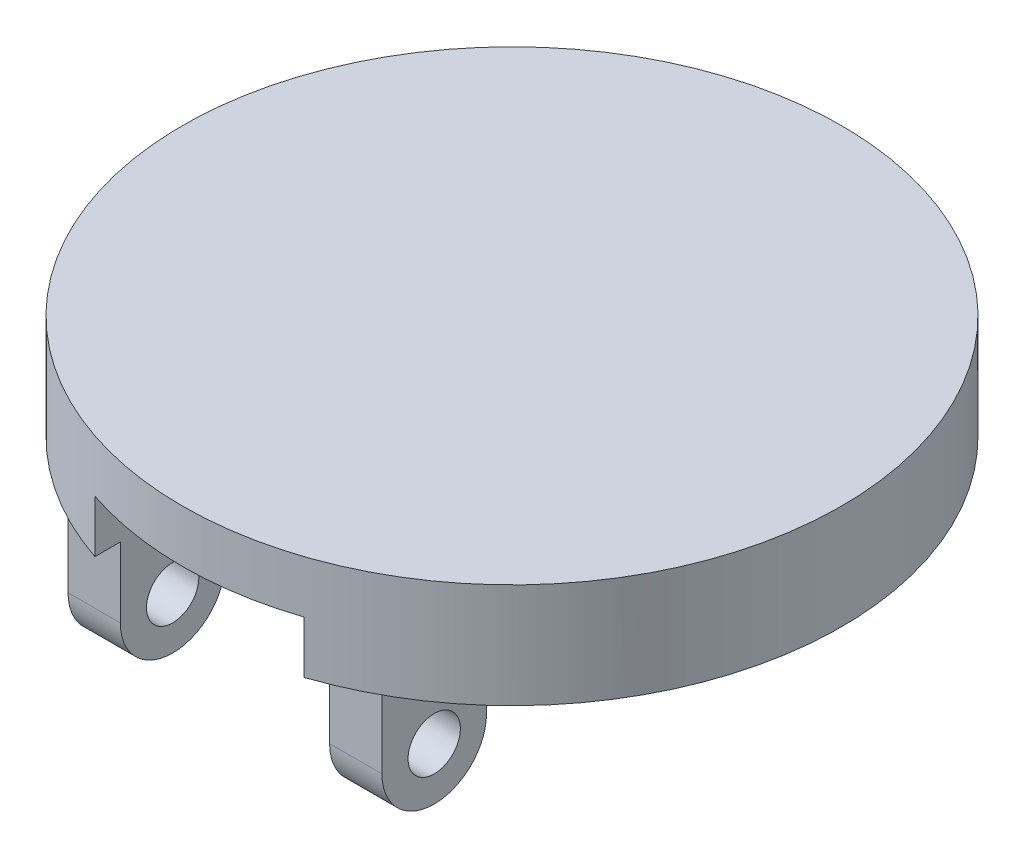
ISO-10303-21;
HEADER;
FILE_DESCRIPTION(('STEP AP214'),'2;1');
FILE_NAME('part.step','',(''),(''),'','','');
FILE_SCHEMA(('AUTOMOTIVE_DESIGN { 1 0 10303 214 1 1 1 1 }'));
ENDSEC;
DATA;
#1=APPLICATION_CONTEXT('core data for automotive mechanical design processes');
#2=APPLICATION_PROTOCOL_DEFINITION('international standard','automotive_design',2000,#1);
#3=PRODUCT_CONTEXT('',#1,'mechanical');
#4=PRODUCT('Part','Part','',(#3));
#5=PRODUCT_RELATED_PRODUCT_CATEGORY('part','',(#4));
#6=PRODUCT_DEFINITION_FORMATION('','',#4);
#7=PRODUCT_DEFINITION_CONTEXT('part definition',#1,'design');
#8=PRODUCT_DEFINITION('design','',#6,#7);
#9=PRODUCT_DEFINITION_SHAPE('','',#8);
#10=(LENGTH_UNIT() NAMED_UNIT(*) SI_UNIT(.MILLI.,.METRE.));
#11=(NAMED_UNIT(*) PLANE_ANGLE_UNIT() SI_UNIT($,.RADIAN.));
#12=(NAMED_UNIT(*) SI_UNIT($,.STERADIAN.) SOLID_ANGLE_UNIT());
#13=UNCERTAINTY_MEASURE_WITH_UNIT(LENGTH_MEASURE(1.E-05),#10,'distance_accuracy_value','');
#14=(GEOMETRIC_REPRESENTATION_CONTEXT(3) GLOBAL_UNCERTAINTY_ASSIGNED_CONTEXT((#13)) GLOBAL_UNIT_ASSIGNED_CONTEXT((#10,
#11,#12)) REPRESENTATION_CONTEXT('',''));
#15=CARTESIAN_POINT('',(0.,0.,0.));
#16=DIRECTION('',(0.,0.,1.));
#17=DIRECTION('',(1.,0.,0.));
#18=AXIS2_PLACEMENT_3D('',#15,#16,#17);
#19=CARTESIAN_POINT('',(0.,6.35,0.));
#20=DIRECTION('',(0.,-1.,0.));
#21=DIRECTION('',(0.,0.,-1.));
#22=AXIS2_PLACEMENT_3D('',#19,#20,#21);
#23=CYLINDRICAL_SURFACE('',#22,20.000000005);
#24=CARTESIAN_POINT('',(0.,6.35,0.));
#25=DIRECTION('',(0.,1.,0.));
#26=DIRECTION('',(0.,0.,1.));
#27=AXIS2_PLACEMENT_3D('',#24,#25,#26);
#28=CIRCLE('',#27,20.000000005);
#29=CARTESIAN_POINT('',(0.,6.35,20.000000005));
#30=VERTEX_POINT('',#29);
#31=EDGE_CURVE('E238',#30,#30,#28,.T.);
#32=ORIENTED_EDGE('',*,*,#31,.F.);
#33=EDGE_LOOP('',(#32));
#34=FACE_BOUND('',#33,.T.);
#35=CARTESIAN_POINT('',(0.,3.175,0.));
#36=DIRECTION('',(0.,-1.,0.));
#37=DIRECTION('',(0.,0.,-1.));
#38=AXIS2_PLACEMENT_3D('',#35,#36,#37);
#39=CIRCLE('',#38,20.000000005);
#40=CARTESIAN_POINT('',(6.35,3.175,18.9651654408813));
#41=VERTEX_POINT('',#40);
#42=CARTESIAN_POINT('',(-6.35,3.175,18.9651654408813));
#43=VERTEX_POINT('',#42);
#44=EDGE_CURVE('E143',#41,#43,#39,.T.);
#45=ORIENTED_EDGE('',*,*,#44,.F.);
#46=DIRECTION('',(0.,-1.,0.));
#47=VECTOR('',#46,1.);
#48=CARTESIAN_POINT('',(6.35,3.175,18.9651654408813));
#49=LINE('',#48,#47);
#50=CARTESIAN_POINT('',(6.35,0.,18.9651654408813));
#51=VERTEX_POINT('',#50);
#52=EDGE_CURVE('E166',#41,#51,#49,.T.);
#53=ORIENTED_EDGE('',*,*,#52,.T.);
#54=CARTESIAN_POINT('',(0.,0.,0.));
#55=DIRECTION('',(0.,1.,0.));
#56=DIRECTION('',(0.,0.,1.));
#57=AXIS2_PLACEMENT_3D('',#54,#55,#56);
#58=CIRCLE('',#57,20.000000005);
#59=CARTESIAN_POINT('',(-6.35,0.,18.9651654408813));
#60=VERTEX_POINT('',#59);
#61=EDGE_CURVE('E156',#51,#60,#58,.T.);
#62=ORIENTED_EDGE('',*,*,#61,.T.);
#63=DIRECTION('',(0.,-1.,0.));
#64=VECTOR('',#63,1.);
#65=CARTESIAN_POINT('',(-6.35,3.175,18.9651654408813));
#66=LINE('',#65,#64);
#67=EDGE_CURVE('E135',#43,#60,#66,.T.);
#68=ORIENTED_EDGE('',*,*,#67,.F.);
#69=EDGE_LOOP('',(#45,#53,#62,#68));
#70=FACE_BOUND('',#69,.T.);
#71=ADVANCED_FACE('F33',(#34,#70),#23,.T.);
#72=CARTESIAN_POINT('',(0.,6.35,0.));
#73=DIRECTION('',(0.,1.,0.));
#74=DIRECTION('',(0.,0.,1.));
#75=AXIS2_PLACEMENT_3D('',#72,#73,#74);
#76=PLANE('',#75);
#77=ORIENTED_EDGE('',*,*,#31,.T.);
#78=EDGE_LOOP('',(#77));
#79=FACE_BOUND('',#78,.T.);
#80=ADVANCED_FACE('F301',(#79),#76,.T.);
#81=CARTESIAN_POINT('',(0.,0.,0.));
#82=DIRECTION('',(0.,1.,0.));
#83=DIRECTION('',(0.,0.,1.));
#84=AXIS2_PLACEMENT_3D('',#81,#82,#83);
#85=PLANE('',#84);
#86=ORIENTED_EDGE('',*,*,#61,.F.);
#87=DIRECTION('',(0.,0.,1.));
#88=VECTOR('',#87,1.);
#89=CARTESIAN_POINT('',(6.35,0.,18.9651654408813));
#90=LINE('',#89,#88);
#91=CARTESIAN_POINT('',(6.35,0.,17.4200827178043));
#92=VERTEX_POINT('',#91);
#93=EDGE_CURVE('E262',#92,#51,#90,.T.);
#94=ORIENTED_EDGE('',*,*,#93,.F.);
#95=DIRECTION('',(-1.,0.,0.));
#96=VECTOR('',#95,1.);
#97=CARTESIAN_POINT('',(9.525,0.,17.4200827178043));
#98=LINE('',#97,#96);
#99=CARTESIAN_POINT('',(9.525,0.,17.4200827178043));
#100=VERTEX_POINT('',#99);
#101=EDGE_CURVE('E235',#100,#92,#98,.T.);
#102=ORIENTED_EDGE('',*,*,#101,.F.);
#103=DIRECTION('',(0.,0.,-1.));
#104=VECTOR('',#103,1.);
#105=CARTESIAN_POINT('',(9.525,0.,0.));
#106=LINE('',#105,#104);
#107=CARTESIAN_POINT('',(9.525,0.,7.89508271780427));
#108=VERTEX_POINT('',#107);
#109=EDGE_CURVE('E41',#100,#108,#106,.T.);
#110=ORIENTED_EDGE('',*,*,#109,.T.);
#111=DIRECTION('',(-1.,0.,0.));
#112=VECTOR('',#111,1.);
#113=CARTESIAN_POINT('',(9.525,0.,7.89508271780427));
#114=LINE('',#113,#112);
#115=CARTESIAN_POINT('',(6.35,0.,7.89508271780427));
#116=VERTEX_POINT('',#115);
#117=EDGE_CURVE('E216',#108,#116,#114,.T.);
#118=ORIENTED_EDGE('',*,*,#117,.T.);
#119=CARTESIAN_POINT('',(6.35,0.,7.6056090725816));
#120=VERTEX_POINT('',#119);
#121=EDGE_CURVE('E152',#120,#116,#90,.T.);
#122=ORIENTED_EDGE('',*,*,#121,.F.);
#123=CARTESIAN_POINT('',(0.,0.,0.));
#124=DIRECTION('',(0.,-1.,0.));
#125=DIRECTION('',(0.,0.,-1.));
#126=AXIS2_PLACEMENT_3D('',#123,#124,#125);
#127=CIRCLE('',#126,9.90796595497459);
#128=CARTESIAN_POINT('',(-6.35,0.,7.6056090725816));
#129=VERTEX_POINT('',#128);
#130=EDGE_CURVE('E264',#129,#120,#127,.T.);
#131=ORIENTED_EDGE('',*,*,#130,.F.);
#132=DIRECTION('',(0.,0.,-1.));
#133=VECTOR('',#132,1.);
#134=CARTESIAN_POINT('',(-6.35,0.,7.6056090725816));
#135=LINE('',#134,#133);
#136=CARTESIAN_POINT('',(-6.35,0.,7.89508271780427));
#137=VERTEX_POINT('',#136);
#138=EDGE_CURVE('E270',#137,#129,#135,.T.);
#139=ORIENTED_EDGE('',*,*,#138,.F.);
#140=DIRECTION('',(1.,0.,0.));
#141=VECTOR('',#140,1.);
#142=CARTESIAN_POINT('',(-9.525,0.,7.89508271780427));
#143=LINE('',#142,#141);
#144=CARTESIAN_POINT('',(-9.525,0.,7.89508271780427));
#145=VERTEX_POINT('',#144);
#146=EDGE_CURVE('E47',#145,#137,#143,.T.);
#147=ORIENTED_EDGE('',*,*,#146,.F.);
#148=DIRECTION('',(0.,0.,1.));
#149=VECTOR('',#148,1.);
#150=CARTESIAN_POINT('',(-9.525,0.,0.));
#151=LINE('',#150,#149);
#152=CARTESIAN_POINT('',(-9.525,0.,17.4200827178043));
#153=VERTEX_POINT('',#152);
#154=EDGE_CURVE('E11',#145,#153,#151,.T.);
#155=ORIENTED_EDGE('',*,*,#154,.T.);
#156=DIRECTION('',(1.,0.,0.));
#157=VECTOR('',#156,1.);
#158=CARTESIAN_POINT('',(-9.525,0.,17.4200827178043));
#159=LINE('',#158,#157);
#160=CARTESIAN_POINT('',(-6.35,0.,17.4200827178043));
#161=VERTEX_POINT('',#160);
#162=EDGE_CURVE('E187',#153,#161,#159,.T.);
#163=ORIENTED_EDGE('',*,*,#162,.T.);
#164=EDGE_CURVE('E268',#60,#161,#135,.T.);
#165=ORIENTED_EDGE('',*,*,#164,.F.);
#166=EDGE_LOOP('',(#86,#94,#102,#110,#118,#122,#131,#139,#147,#155,#163,#165));
#167=FACE_BOUND('',#166,.T.);
#168=ADVANCED_FACE('F243',(#167),#85,.F.);
#169=CARTESIAN_POINT('',(9.525,-3.17499999999998,7.89508271780427));
#170=DIRECTION('',(1.,0.,0.));
#171=DIRECTION('',(0.,0.,-1.));
#172=AXIS2_PLACEMENT_3D('',#169,#170,#171);
#173=PLANE('',#172);
#174=CARTESIAN_POINT('',(9.525,-4.25399999999997,14.2450827178043));
#175=DIRECTION('',(1.,0.,0.));
#176=DIRECTION('',(0.,0.,-1.));
#177=AXIS2_PLACEMENT_3D('',#174,#175,#176);
#178=CIRCLE('',#177,1.5875);
#179=CARTESIAN_POINT('',(9.525,-4.25399999999997,12.6575827178043));
#180=VERTEX_POINT('',#179);
#181=EDGE_CURVE('E163',#180,#180,#178,.T.);
#182=ORIENTED_EDGE('',*,*,#181,.F.);
#183=EDGE_LOOP('',(#182));
#184=FACE_BOUND('',#183,.T.);
#185=ORIENTED_EDGE('',*,*,#109,.F.);
#186=DIRECTION('',(0.,-1.,0.));
#187=VECTOR('',#186,1.);
#188=CARTESIAN_POINT('',(9.525,0.,17.4200827178043));
#189=LINE('',#188,#187);
#190=CARTESIAN_POINT('',(9.525,-4.25399999999997,17.4200827178043));
#191=VERTEX_POINT('',#190);
#192=EDGE_CURVE('E206',#100,#191,#189,.T.);
#193=ORIENTED_EDGE('',*,*,#192,.T.);
#194=CARTESIAN_POINT('',(9.525,-4.25399999999997,14.2450827178043));
#195=DIRECTION('',(1.,0.,0.));
#196=DIRECTION('',(0.,0.,-1.));
#197=AXIS2_PLACEMENT_3D('',#194,#195,#196);
#198=CIRCLE('',#197,3.175);
#199=CARTESIAN_POINT('',(9.525,-4.25399999999997,11.0700827178043));
#200=VERTEX_POINT('',#199);
#201=EDGE_CURVE('E208',#191,#200,#198,.T.);
#202=ORIENTED_EDGE('',*,*,#201,.T.);
#203=DIRECTION('',(0.,1.,0.));
#204=VECTOR('',#203,1.);
#205=CARTESIAN_POINT('',(9.525,-3.17499999999998,11.0700827178043));
#206=LINE('',#205,#204);
#207=CARTESIAN_POINT('',(9.525,-3.17499999999998,11.0700827178043));
#208=VERTEX_POINT('',#207);
#209=EDGE_CURVE('E211',#200,#208,#206,.T.);
#210=ORIENTED_EDGE('',*,*,#209,.T.);
#211=CARTESIAN_POINT('',(9.525,-3.17499999999998,7.89508271780427));
#212=DIRECTION('',(-1.,0.,0.));
#213=DIRECTION('',(0.,0.,-1.));
#214=AXIS2_PLACEMENT_3D('',#211,#212,#213);
#215=CIRCLE('',#214,3.175);
#216=EDGE_CURVE('E213',#208,#108,#215,.T.);
#217=ORIENTED_EDGE('',*,*,#216,.T.);
#218=EDGE_LOOP('',(#185,#193,#202,#210,#217));
#219=FACE_BOUND('',#218,.T.);
#220=ADVANCED_FACE('F249',(#184,#219),#173,.T.);
#221=CARTESIAN_POINT('',(6.35,-3.17499999999998,7.89508271780427));
#222=DIRECTION('',(1.,0.,0.));
#223=DIRECTION('',(0.,0.,-1.));
#224=AXIS2_PLACEMENT_3D('',#221,#222,#223);
#225=PLANE('',#224);
#226=CARTESIAN_POINT('',(6.35,-4.25399999999997,14.2450827178043));
#227=DIRECTION('',(1.,0.,0.));
#228=DIRECTION('',(0.,0.,-1.));
#229=AXIS2_PLACEMENT_3D('',#226,#227,#228);
#230=CIRCLE('',#229,1.5875);
#231=CARTESIAN_POINT('',(6.35,-4.25399999999997,12.6575827178043));
#232=VERTEX_POINT('',#231);
#233=EDGE_CURVE('E170',#232,#232,#230,.T.);
#234=ORIENTED_EDGE('',*,*,#233,.T.);
#235=EDGE_LOOP('',(#234));
#236=FACE_BOUND('',#235,.T.);
#237=DIRECTION('',(0.,-1.,0.));
#238=VECTOR('',#237,1.);
#239=CARTESIAN_POINT('',(6.35,0.,17.4200827178043));
#240=LINE('',#239,#238);
#241=CARTESIAN_POINT('',(6.35,-4.25399999999997,17.4200827178043));
#242=VERTEX_POINT('',#241);
#243=EDGE_CURVE('E205',#92,#242,#240,.T.);
#244=ORIENTED_EDGE('',*,*,#243,.F.);
#245=ORIENTED_EDGE('',*,*,#93,.T.);
#246=ORIENTED_EDGE('',*,*,#52,.F.);
#247=DIRECTION('',(0.,0.,1.));
#248=VECTOR('',#247,1.);
#249=CARTESIAN_POINT('',(6.35,3.175,18.9651654408813));
#250=LINE('',#249,#248);
#251=CARTESIAN_POINT('',(6.35,3.175,7.6056090725816));
#252=VERTEX_POINT('',#251);
#253=EDGE_CURVE('E149',#252,#41,#250,.T.);
#254=ORIENTED_EDGE('',*,*,#253,.F.);
#255=DIRECTION('',(0.,-1.,0.));
#256=VECTOR('',#255,1.);
#257=CARTESIAN_POINT('',(6.35,3.175,7.6056090725816));
#258=LINE('',#257,#256);
#259=EDGE_CURVE('E158',#252,#120,#258,.T.);
#260=ORIENTED_EDGE('',*,*,#259,.T.);
#261=ORIENTED_EDGE('',*,*,#121,.T.);
#262=CARTESIAN_POINT('',(6.35,-3.17499999999998,7.89508271780427));
#263=DIRECTION('',(-1.,0.,0.));
#264=DIRECTION('',(0.,0.,-1.));
#265=AXIS2_PLACEMENT_3D('',#262,#263,#264);
#266=CIRCLE('',#265,3.175);
#267=CARTESIAN_POINT('',(6.35,-3.17499999999998,11.0700827178043));
#268=VERTEX_POINT('',#267);
#269=EDGE_CURVE('E209',#268,#116,#266,.T.);
#270=ORIENTED_EDGE('',*,*,#269,.F.);
#271=DIRECTION('',(0.,1.,0.));
#272=VECTOR('',#271,1.);
#273=CARTESIAN_POINT('',(6.35,-3.17499999999998,11.0700827178043));
#274=LINE('',#273,#272);
#275=CARTESIAN_POINT('',(6.35,-4.25399999999997,11.0700827178043));
#276=VERTEX_POINT('',#275);
#277=EDGE_CURVE('E220',#276,#268,#274,.T.);
#278=ORIENTED_EDGE('',*,*,#277,.F.);
#279=CARTESIAN_POINT('',(6.35,-4.25399999999997,14.2450827178043));
#280=DIRECTION('',(1.,0.,0.));
#281=DIRECTION('',(0.,0.,-1.));
#282=AXIS2_PLACEMENT_3D('',#279,#280,#281);
#283=CIRCLE('',#282,3.175);
#284=EDGE_CURVE('E218',#242,#276,#283,.T.);
#285=ORIENTED_EDGE('',*,*,#284,.F.);
#286=EDGE_LOOP('',(#244,#245,#246,#254,#260,#261,#270,#278,#285));
#287=FACE_BOUND('',#286,.T.);
#288=ADVANCED_FACE('F258',(#236,#287),#225,.F.);
#289=CARTESIAN_POINT('',(9.525,0.,17.4200827178043));
#290=DIRECTION('',(0.,0.,-1.));
#291=DIRECTION('',(0.,1.,0.));
#292=AXIS2_PLACEMENT_3D('',#289,#290,#291);
#293=PLANE('',#292);
#294=ORIENTED_EDGE('',*,*,#243,.T.);
#295=DIRECTION('',(-1.,0.,0.));
#296=VECTOR('',#295,1.);
#297=CARTESIAN_POINT('',(9.525,-4.25399999999997,17.4200827178043));
#298=LINE('',#297,#296);
#299=EDGE_CURVE('E232',#191,#242,#298,.T.);
#300=ORIENTED_EDGE('',*,*,#299,.F.);
#301=ORIENTED_EDGE('',*,*,#192,.F.);
#302=ORIENTED_EDGE('',*,*,#101,.T.);
#303=EDGE_LOOP('',(#294,#300,#301,#302));
#304=FACE_BOUND('',#303,.T.);
#305=ADVANCED_FACE('F313',(#304),#293,.F.);
#306=CARTESIAN_POINT('',(9.525,-4.25399999999997,14.2450827178043));
#307=DIRECTION('',(-1.,0.,0.));
#308=DIRECTION('',(0.,0.,1.));
#309=AXIS2_PLACEMENT_3D('',#306,#307,#308);
#310=CYLINDRICAL_SURFACE('',#309,3.175);
#311=ORIENTED_EDGE('',*,*,#284,.T.);
#312=DIRECTION('',(-1.,0.,0.));
#313=VECTOR('',#312,1.);
#314=CARTESIAN_POINT('',(9.525,-4.25399999999997,11.0700827178043));
#315=LINE('',#314,#313);
#316=EDGE_CURVE('E229',#200,#276,#315,.T.);
#317=ORIENTED_EDGE('',*,*,#316,.F.);
#318=ORIENTED_EDGE('',*,*,#201,.F.);
#319=ORIENTED_EDGE('',*,*,#299,.T.);
#320=EDGE_LOOP('',(#311,#317,#318,#319));
#321=FACE_BOUND('',#320,.T.);
#322=ADVANCED_FACE('F316',(#321),#310,.T.);
#323=CARTESIAN_POINT('',(9.525,-3.17499999999998,11.0700827178043));
#324=DIRECTION('',(0.,0.,1.));
#325=DIRECTION('',(1.,0.,0.));
#326=AXIS2_PLACEMENT_3D('',#323,#324,#325);
#327=PLANE('',#326);
#328=ORIENTED_EDGE('',*,*,#277,.T.);
#329=DIRECTION('',(-1.,0.,0.));
#330=VECTOR('',#329,1.);
#331=CARTESIAN_POINT('',(9.525,-3.17499999999998,11.0700827178043));
#332=LINE('',#331,#330);
#333=EDGE_CURVE('E226',#208,#268,#332,.T.);
#334=ORIENTED_EDGE('',*,*,#333,.F.);
#335=ORIENTED_EDGE('',*,*,#209,.F.);
#336=ORIENTED_EDGE('',*,*,#316,.T.);
#337=EDGE_LOOP('',(#328,#334,#335,#336));
#338=FACE_BOUND('',#337,.T.);
#339=ADVANCED_FACE('F320',(#338),#327,.F.);
#340=CARTESIAN_POINT('',(9.525,-3.17499999999998,7.89508271780427));
#341=DIRECTION('',(-1.,0.,0.));
#342=DIRECTION('',(0.,0.,1.));
#343=AXIS2_PLACEMENT_3D('',#340,#341,#342);
#344=CYLINDRICAL_SURFACE('',#343,3.175);
#345=ORIENTED_EDGE('',*,*,#269,.T.);
#346=ORIENTED_EDGE('',*,*,#117,.F.);
#347=ORIENTED_EDGE('',*,*,#216,.F.);
#348=ORIENTED_EDGE('',*,*,#333,.T.);
#349=EDGE_LOOP('',(#345,#346,#347,#348));
#350=FACE_BOUND('',#349,.T.);
#351=ADVANCED_FACE('F253',(#350),#344,.F.);
#352=CARTESIAN_POINT('',(-9.525,-3.17499999999998,7.89508271780427));
#353=DIRECTION('',(-1.,0.,0.));
#354=DIRECTION('',(0.,0.,-1.));
#355=AXIS2_PLACEMENT_3D('',#352,#353,#354);
#356=PLANE('',#355);
#357=CARTESIAN_POINT('',(-9.525,-4.25399999999997,14.2450827178043));
#358=DIRECTION('',(-1.,0.,0.));
#359=DIRECTION('',(0.,0.,1.));
#360=AXIS2_PLACEMENT_3D('',#357,#358,#359);
#361=CIRCLE('',#360,1.5875);
#362=CARTESIAN_POINT('',(-9.525,-4.25399999999997,15.8325827178043));
#363=VERTEX_POINT('',#362);
#364=EDGE_CURVE('E167',#363,#363,#361,.T.);
#365=ORIENTED_EDGE('',*,*,#364,.F.);
#366=EDGE_LOOP('',(#365));
#367=FACE_BOUND('',#366,.T.);
#368=ORIENTED_EDGE('',*,*,#154,.F.);
#369=CARTESIAN_POINT('',(-9.525,-3.17499999999998,7.89508271780427));
#370=DIRECTION('',(-1.,0.,0.));
#371=DIRECTION('',(0.,0.,-1.));
#372=AXIS2_PLACEMENT_3D('',#369,#370,#371);
#373=CIRCLE('',#372,3.175);
#374=CARTESIAN_POINT('',(-9.525,-3.17499999999998,11.0700827178043));
#375=VERTEX_POINT('',#374);
#376=EDGE_CURVE('E174',#375,#145,#373,.T.);
#377=ORIENTED_EDGE('',*,*,#376,.F.);
#378=DIRECTION('',(0.,1.,0.));
#379=VECTOR('',#378,1.);
#380=CARTESIAN_POINT('',(-9.525,-3.17499999999998,11.0700827178043));
#381=LINE('',#380,#379);
#382=CARTESIAN_POINT('',(-9.525,-4.25399999999997,11.0700827178043));
#383=VERTEX_POINT('',#382);
#384=EDGE_CURVE('E177',#383,#375,#381,.T.);
#385=ORIENTED_EDGE('',*,*,#384,.F.);
#386=CARTESIAN_POINT('',(-9.525,-4.25399999999997,14.2450827178043));
#387=DIRECTION('',(1.,0.,0.));
#388=DIRECTION('',(0.,0.,-1.));
#389=AXIS2_PLACEMENT_3D('',#386,#387,#388);
#390=CIRCLE('',#389,3.175);
#391=CARTESIAN_POINT('',(-9.525,-4.25399999999997,17.4200827178043));
#392=VERTEX_POINT('',#391);
#393=EDGE_CURVE('E181',#392,#383,#390,.T.);
#394=ORIENTED_EDGE('',*,*,#393,.F.);
#395=DIRECTION('',(0.,-1.,0.));
#396=VECTOR('',#395,1.);
#397=CARTESIAN_POINT('',(-9.525,0.,17.4200827178043));
#398=LINE('',#397,#396);
#399=EDGE_CURVE('E184',#153,#392,#398,.T.);
#400=ORIENTED_EDGE('',*,*,#399,.F.);
#401=EDGE_LOOP('',(#368,#377,#385,#394,#400));
#402=FACE_BOUND('',#401,.T.);
#403=ADVANCED_FACE('F284',(#367,#402),#356,.T.);
#404=CARTESIAN_POINT('',(-6.35,-3.17499999999998,7.89508271780427));
#405=DIRECTION('',(-1.,0.,0.));
#406=DIRECTION('',(0.,0.,-1.));
#407=AXIS2_PLACEMENT_3D('',#404,#405,#406);
#408=PLANE('',#407);
#409=CARTESIAN_POINT('',(-6.35,-4.25399999999997,14.2450827178043));
#410=DIRECTION('',(-1.,0.,0.));
#411=DIRECTION('',(0.,0.,1.));
#412=AXIS2_PLACEMENT_3D('',#409,#410,#411);
#413=CIRCLE('',#412,1.5875);
#414=CARTESIAN_POINT('',(-6.35,-4.25399999999997,15.8325827178043));
#415=VERTEX_POINT('',#414);
#416=EDGE_CURVE('E36',#415,#415,#413,.T.);
#417=ORIENTED_EDGE('',*,*,#416,.T.);
#418=EDGE_LOOP('',(#417));
#419=FACE_BOUND('',#418,.T.);
#420=CARTESIAN_POINT('',(-6.35,-3.17499999999998,7.89508271780427));
#421=DIRECTION('',(-1.,0.,0.));
#422=DIRECTION('',(0.,0.,-1.));
#423=AXIS2_PLACEMENT_3D('',#420,#421,#422);
#424=CIRCLE('',#423,3.175);
#425=CARTESIAN_POINT('',(-6.35,-3.17499999999998,11.0700827178043));
#426=VERTEX_POINT('',#425);
#427=EDGE_CURVE('E173',#426,#137,#424,.T.);
#428=ORIENTED_EDGE('',*,*,#427,.T.);
#429=ORIENTED_EDGE('',*,*,#138,.T.);
#430=DIRECTION('',(0.,-1.,0.));
#431=VECTOR('',#430,1.);
#432=CARTESIAN_POINT('',(-6.35,3.175,7.6056090725816));
#433=LINE('',#432,#431);
#434=CARTESIAN_POINT('',(-6.35,3.175,7.6056090725816));
#435=VERTEX_POINT('',#434);
#436=EDGE_CURVE('E138',#435,#129,#433,.T.);
#437=ORIENTED_EDGE('',*,*,#436,.F.);
#438=DIRECTION('',(0.,0.,-1.));
#439=VECTOR('',#438,1.);
#440=CARTESIAN_POINT('',(-6.35,3.175,7.6056090725816));
#441=LINE('',#440,#439);
#442=EDGE_CURVE('E130',#43,#435,#441,.T.);
#443=ORIENTED_EDGE('',*,*,#442,.F.);
#444=ORIENTED_EDGE('',*,*,#67,.T.);
#445=ORIENTED_EDGE('',*,*,#164,.T.);
#446=DIRECTION('',(0.,-1.,0.));
#447=VECTOR('',#446,1.);
#448=CARTESIAN_POINT('',(-6.35,0.,17.4200827178043));
#449=LINE('',#448,#447);
#450=CARTESIAN_POINT('',(-6.35,-4.25399999999997,17.4200827178043));
#451=VERTEX_POINT('',#450);
#452=EDGE_CURVE('E178',#161,#451,#449,.T.);
#453=ORIENTED_EDGE('',*,*,#452,.T.);
#454=CARTESIAN_POINT('',(-6.35,-4.25399999999997,14.2450827178043));
#455=DIRECTION('',(1.,0.,0.));
#456=DIRECTION('',(0.,0.,-1.));
#457=AXIS2_PLACEMENT_3D('',#454,#455,#456);
#458=CIRCLE('',#457,3.175);
#459=CARTESIAN_POINT('',(-6.35,-4.25399999999997,11.0700827178043));
#460=VERTEX_POINT('',#459);
#461=EDGE_CURVE('E192',#451,#460,#458,.T.);
#462=ORIENTED_EDGE('',*,*,#461,.T.);
#463=DIRECTION('',(0.,1.,0.));
#464=VECTOR('',#463,1.);
#465=CARTESIAN_POINT('',(-6.35,-3.17499999999998,11.0700827178043));
#466=LINE('',#465,#464);
#467=EDGE_CURVE('E189',#460,#426,#466,.T.);
#468=ORIENTED_EDGE('',*,*,#467,.T.);
#469=EDGE_LOOP('',(#428,#429,#437,#443,#444,#445,#453,#462,#468));
#470=FACE_BOUND('',#469,.T.);
#471=ADVANCED_FACE('F133',(#419,#470),#408,.F.);
#472=CARTESIAN_POINT('',(-9.525,-3.17499999999998,7.89508271780427));
#473=DIRECTION('',(1.,0.,0.));
#474=DIRECTION('',(0.,0.,-1.));
#475=AXIS2_PLACEMENT_3D('',#472,#473,#474);
#476=CYLINDRICAL_SURFACE('',#475,3.175);
#477=ORIENTED_EDGE('',*,*,#427,.F.);
#478=DIRECTION('',(1.,0.,0.));
#479=VECTOR('',#478,1.);
#480=CARTESIAN_POINT('',(-9.525,-3.17499999999998,11.0700827178043));
#481=LINE('',#480,#479);
#482=EDGE_CURVE('E202',#375,#426,#481,.T.);
#483=ORIENTED_EDGE('',*,*,#482,.F.);
#484=ORIENTED_EDGE('',*,*,#376,.T.);
#485=ORIENTED_EDGE('',*,*,#146,.T.);
#486=EDGE_LOOP('',(#477,#483,#484,#485));
#487=FACE_BOUND('',#486,.T.);
#488=ADVANCED_FACE('F276',(#487),#476,.F.);
#489=CARTESIAN_POINT('',(-9.525,-3.17499999999998,11.0700827178043));
#490=DIRECTION('',(0.,0.,-1.));
#491=DIRECTION('',(-1.,0.,0.));
#492=AXIS2_PLACEMENT_3D('',#489,#490,#491);
#493=PLANE('',#492);
#494=ORIENTED_EDGE('',*,*,#467,.F.);
#495=DIRECTION('',(1.,0.,0.));
#496=VECTOR('',#495,1.);
#497=CARTESIAN_POINT('',(-9.525,-4.25399999999997,11.0700827178043));
#498=LINE('',#497,#496);
#499=EDGE_CURVE('E200',#383,#460,#498,.T.);
#500=ORIENTED_EDGE('',*,*,#499,.F.);
#501=ORIENTED_EDGE('',*,*,#384,.T.);
#502=ORIENTED_EDGE('',*,*,#482,.T.);
#503=EDGE_LOOP('',(#494,#500,#501,#502));
#504=FACE_BOUND('',#503,.T.);
#505=ADVANCED_FACE('F281',(#504),#493,.T.);
#506=CARTESIAN_POINT('',(-9.525,-4.25399999999997,14.2450827178043));
#507=DIRECTION('',(1.,0.,0.));
#508=DIRECTION('',(0.,0.,-1.));
#509=AXIS2_PLACEMENT_3D('',#506,#507,#508);
#510=CYLINDRICAL_SURFACE('',#509,3.175);
#511=ORIENTED_EDGE('',*,*,#461,.F.);
#512=DIRECTION('',(1.,0.,0.));
#513=VECTOR('',#512,1.);
#514=CARTESIAN_POINT('',(-9.525,-4.25399999999997,17.4200827178043));
#515=LINE('',#514,#513);
#516=EDGE_CURVE('E198',#392,#451,#515,.T.);
#517=ORIENTED_EDGE('',*,*,#516,.F.);
#518=ORIENTED_EDGE('',*,*,#393,.T.);
#519=ORIENTED_EDGE('',*,*,#499,.T.);
#520=EDGE_LOOP('',(#511,#517,#518,#519));
#521=FACE_BOUND('',#520,.T.);
#522=ADVANCED_FACE('F290',(#521),#510,.T.);
#523=CARTESIAN_POINT('',(-9.525,0.,17.4200827178043));
#524=DIRECTION('',(0.,0.,1.));
#525=DIRECTION('',(0.,-1.,0.));
#526=AXIS2_PLACEMENT_3D('',#523,#524,#525);
#527=PLANE('',#526);
#528=ORIENTED_EDGE('',*,*,#452,.F.);
#529=ORIENTED_EDGE('',*,*,#162,.F.);
#530=ORIENTED_EDGE('',*,*,#399,.T.);
#531=ORIENTED_EDGE('',*,*,#516,.T.);
#532=EDGE_LOOP('',(#528,#529,#530,#531));
#533=FACE_BOUND('',#532,.T.);
#534=ADVANCED_FACE('F288',(#533),#527,.T.);
#535=CARTESIAN_POINT('',(-20.000000005,-4.25399999999997,14.2450827178043));
#536=DIRECTION('',(1.,0.,0.));
#537=DIRECTION('',(0.,0.,-1.));
#538=AXIS2_PLACEMENT_3D('',#535,#536,#537);
#539=CYLINDRICAL_SURFACE('',#538,1.5875);
#540=ORIENTED_EDGE('',*,*,#364,.T.);
#541=EDGE_LOOP('',(#540));
#542=FACE_BOUND('',#541,.T.);
#543=ORIENTED_EDGE('',*,*,#416,.F.);
#544=EDGE_LOOP('',(#543));
#545=FACE_BOUND('',#544,.T.);
#546=ADVANCED_FACE('F297',(#542,#545),#539,.F.);
#547=ORIENTED_EDGE('',*,*,#181,.T.);
#548=EDGE_LOOP('',(#547));
#549=FACE_BOUND('',#548,.T.);
#550=ORIENTED_EDGE('',*,*,#233,.F.);
#551=EDGE_LOOP('',(#550));
#552=FACE_BOUND('',#551,.T.);
#553=ADVANCED_FACE('F346',(#549,#552),#539,.F.);
#554=CARTESIAN_POINT('',(0.,3.175,0.));
#555=DIRECTION('',(0.,-1.,0.));
#556=DIRECTION('',(0.,0.,-1.));
#557=AXIS2_PLACEMENT_3D('',#554,#555,#556);
#558=CYLINDRICAL_SURFACE('',#557,9.90796595497459);
#559=ORIENTED_EDGE('',*,*,#130,.T.);
#560=ORIENTED_EDGE('',*,*,#259,.F.);
#561=CARTESIAN_POINT('',(0.,3.175,0.));
#562=DIRECTION('',(0.,-1.,0.));
#563=DIRECTION('',(0.,0.,-1.));
#564=AXIS2_PLACEMENT_3D('',#561,#562,#563);
#565=CIRCLE('',#564,9.90796595497459);
#566=EDGE_CURVE('E142',#435,#252,#565,.T.);
#567=ORIENTED_EDGE('',*,*,#566,.F.);
#568=ORIENTED_EDGE('',*,*,#436,.T.);
#569=EDGE_LOOP('',(#559,#560,#567,#568));
#570=FACE_BOUND('',#569,.T.);
#571=ADVANCED_FACE('F273',(#570),#558,.F.);
#572=CARTESIAN_POINT('',(0.,3.175,0.));
#573=DIRECTION('',(0.,-1.,0.));
#574=DIRECTION('',(0.,0.,-1.));
#575=AXIS2_PLACEMENT_3D('',#572,#573,#574);
#576=PLANE('',#575);
#577=ORIENTED_EDGE('',*,*,#44,.T.);
#578=ORIENTED_EDGE('',*,*,#442,.T.);
#579=ORIENTED_EDGE('',*,*,#566,.T.);
#580=ORIENTED_EDGE('',*,*,#253,.T.);
#581=EDGE_LOOP('',(#577,#578,#579,#580));
#582=FACE_BOUND('',#581,.T.);
#583=ADVANCED_FACE('F147',(#582),#576,.T.);
#584=CLOSED_SHELL('',(#71,#80,#168,#220,#288,#305,#322,#339,#351,#403,#471,#488,#505,#522,#534,
#546,#553,#571,#583));
#585=MANIFOLD_SOLID_BREP('B2',#584);
#586=ADVANCED_BREP_SHAPE_REPRESENTATION('',(#18,#585),#14);
#587=SHAPE_DEFINITION_REPRESENTATION(#9,#586);
ENDSEC;
END-ISO-10303-21;
